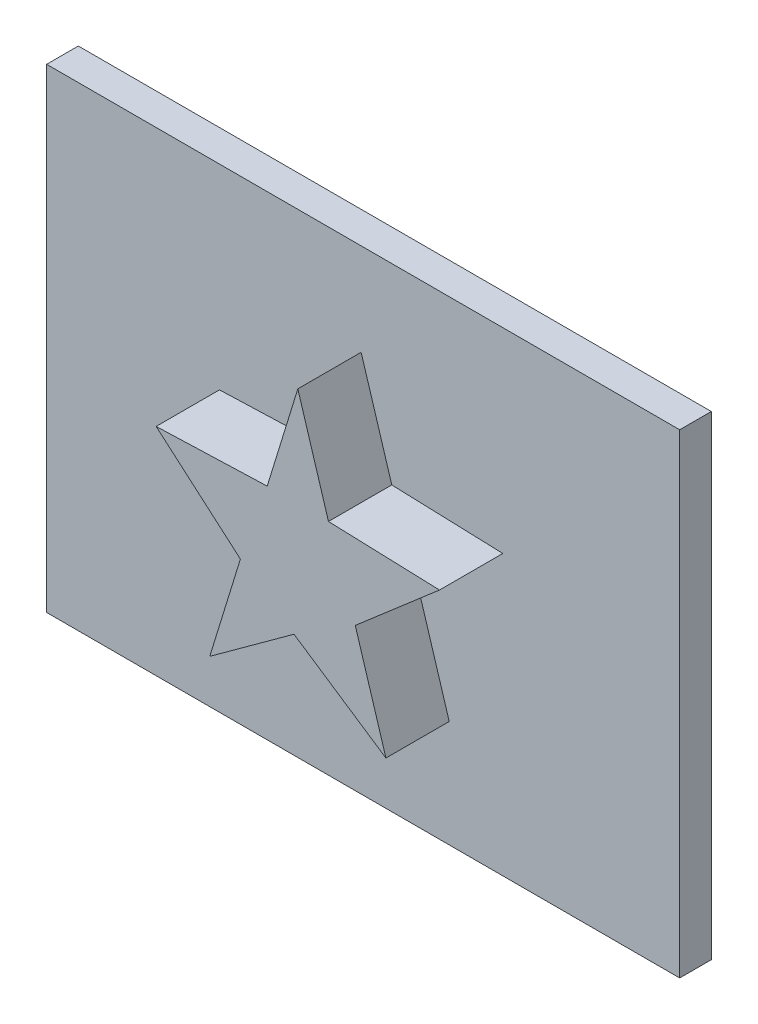
ISO-10303-21;
HEADER;
FILE_DESCRIPTION(('STEP AP214'),'2;1');
FILE_NAME('part.step','',(''),(''),'','','');
FILE_SCHEMA(('AUTOMOTIVE_DESIGN { 1 0 10303 214 1 1 1 1 }'));
ENDSEC;
DATA;
#1=APPLICATION_CONTEXT('core data for automotive mechanical design processes');
#2=APPLICATION_PROTOCOL_DEFINITION('international standard','automotive_design',2000,#1);
#3=PRODUCT_CONTEXT('',#1,'mechanical');
#4=PRODUCT('Part','Part','',(#3));
#5=PRODUCT_RELATED_PRODUCT_CATEGORY('part','',(#4));
#6=PRODUCT_DEFINITION_FORMATION('','',#4);
#7=PRODUCT_DEFINITION_CONTEXT('part definition',#1,'design');
#8=PRODUCT_DEFINITION('design','',#6,#7);
#9=PRODUCT_DEFINITION_SHAPE('','',#8);
#10=(LENGTH_UNIT() NAMED_UNIT(*) SI_UNIT(.MILLI.,.METRE.));
#11=(NAMED_UNIT(*) PLANE_ANGLE_UNIT() SI_UNIT($,.RADIAN.));
#12=(NAMED_UNIT(*) SI_UNIT($,.STERADIAN.) SOLID_ANGLE_UNIT());
#13=UNCERTAINTY_MEASURE_WITH_UNIT(LENGTH_MEASURE(1.E-05),#10,'distance_accuracy_value','');
#14=(GEOMETRIC_REPRESENTATION_CONTEXT(3) GLOBAL_UNCERTAINTY_ASSIGNED_CONTEXT((#13)) GLOBAL_UNIT_ASSIGNED_CONTEXT((#10,
#11,#12)) REPRESENTATION_CONTEXT('',''));
#15=CARTESIAN_POINT('',(0.,0.,0.));
#16=DIRECTION('',(0.,0.,1.));
#17=DIRECTION('',(1.,0.,0.));
#18=AXIS2_PLACEMENT_3D('',#15,#16,#17);
#19=CARTESIAN_POINT('',(20.,15.,2.));
#20=DIRECTION('',(-1.,0.,0.));
#21=DIRECTION('',(0.,-1.,0.));
#22=AXIS2_PLACEMENT_3D('',#19,#20,#21);
#23=PLANE('',#22);
#24=DIRECTION('',(0.,1.,0.));
#25=VECTOR('',#24,1.);
#26=CARTESIAN_POINT('',(20.,15.,0.));
#27=LINE('',#26,#25);
#28=CARTESIAN_POINT('',(20.,-15.,0.));
#29=VERTEX_POINT('',#28);
#30=CARTESIAN_POINT('',(20.,15.,0.));
#31=VERTEX_POINT('',#30);
#32=EDGE_CURVE('E164',#29,#31,#27,.T.);
#33=ORIENTED_EDGE('',*,*,#32,.T.);
#34=DIRECTION('',(0.,0.,-1.));
#35=VECTOR('',#34,1.);
#36=CARTESIAN_POINT('',(20.,15.,2.));
#37=LINE('',#36,#35);
#38=CARTESIAN_POINT('',(20.,15.,2.));
#39=VERTEX_POINT('',#38);
#40=EDGE_CURVE('E12',#39,#31,#37,.T.);
#41=ORIENTED_EDGE('',*,*,#40,.F.);
#42=DIRECTION('',(0.,1.,0.));
#43=VECTOR('',#42,1.);
#44=CARTESIAN_POINT('',(20.,15.,2.));
#45=LINE('',#44,#43);
#46=CARTESIAN_POINT('',(20.,-15.,2.));
#47=VERTEX_POINT('',#46);
#48=EDGE_CURVE('E173',#47,#39,#45,.T.);
#49=ORIENTED_EDGE('',*,*,#48,.F.);
#50=DIRECTION('',(0.,0.,-1.));
#51=VECTOR('',#50,1.);
#52=CARTESIAN_POINT('',(20.,-15.,2.));
#53=LINE('',#52,#51);
#54=EDGE_CURVE('E182',#47,#29,#53,.T.);
#55=ORIENTED_EDGE('',*,*,#54,.T.);
#56=EDGE_LOOP('',(#33,#41,#49,#55));
#57=FACE_BOUND('',#56,.T.);
#58=ADVANCED_FACE('F44',(#57),#23,.F.);
#59=CARTESIAN_POINT('',(-20.,15.,2.));
#60=DIRECTION('',(0.,-1.,0.));
#61=DIRECTION('',(0.,0.,-1.));
#62=AXIS2_PLACEMENT_3D('',#59,#60,#61);
#63=PLANE('',#62);
#64=DIRECTION('',(-1.,0.,0.));
#65=VECTOR('',#64,1.);
#66=CARTESIAN_POINT('',(-20.,15.,0.));
#67=LINE('',#66,#65);
#68=CARTESIAN_POINT('',(-20.,15.,0.));
#69=VERTEX_POINT('',#68);
#70=EDGE_CURVE('E167',#31,#69,#67,.T.);
#71=ORIENTED_EDGE('',*,*,#70,.T.);
#72=DIRECTION('',(0.,0.,-1.));
#73=VECTOR('',#72,1.);
#74=CARTESIAN_POINT('',(-20.,15.,2.));
#75=LINE('',#74,#73);
#76=CARTESIAN_POINT('',(-20.,15.,2.));
#77=VERTEX_POINT('',#76);
#78=EDGE_CURVE('E51',#77,#69,#75,.T.);
#79=ORIENTED_EDGE('',*,*,#78,.F.);
#80=DIRECTION('',(-1.,0.,0.));
#81=VECTOR('',#80,1.);
#82=CARTESIAN_POINT('',(-20.,15.,2.));
#83=LINE('',#82,#81);
#84=EDGE_CURVE('E176',#39,#77,#83,.T.);
#85=ORIENTED_EDGE('',*,*,#84,.F.);
#86=ORIENTED_EDGE('',*,*,#40,.T.);
#87=EDGE_LOOP('',(#71,#79,#85,#86));
#88=FACE_BOUND('',#87,.T.);
#89=ADVANCED_FACE('F213',(#88),#63,.F.);
#90=CARTESIAN_POINT('',(-20.,15.,2.));
#91=DIRECTION('',(1.,0.,0.));
#92=DIRECTION('',(0.,1.,0.));
#93=AXIS2_PLACEMENT_3D('',#90,#91,#92);
#94=PLANE('',#93);
#95=DIRECTION('',(0.,-1.,0.));
#96=VECTOR('',#95,1.);
#97=CARTESIAN_POINT('',(-20.,15.,0.));
#98=LINE('',#97,#96);
#99=CARTESIAN_POINT('',(-20.,-15.,0.));
#100=VERTEX_POINT('',#99);
#101=EDGE_CURVE('E185',#69,#100,#98,.T.);
#102=ORIENTED_EDGE('',*,*,#101,.T.);
#103=DIRECTION('',(0.,0.,-1.));
#104=VECTOR('',#103,1.);
#105=CARTESIAN_POINT('',(-20.,-15.,2.));
#106=LINE('',#105,#104);
#107=CARTESIAN_POINT('',(-20.,-15.,2.));
#108=VERTEX_POINT('',#107);
#109=EDGE_CURVE('E190',#108,#100,#106,.T.);
#110=ORIENTED_EDGE('',*,*,#109,.F.);
#111=DIRECTION('',(0.,-1.,0.));
#112=VECTOR('',#111,1.);
#113=CARTESIAN_POINT('',(-20.,15.,2.));
#114=LINE('',#113,#112);
#115=EDGE_CURVE('E179',#77,#108,#114,.T.);
#116=ORIENTED_EDGE('',*,*,#115,.F.);
#117=ORIENTED_EDGE('',*,*,#78,.T.);
#118=EDGE_LOOP('',(#102,#110,#116,#117));
#119=FACE_BOUND('',#118,.T.);
#120=ADVANCED_FACE('F197',(#119),#94,.F.);
#121=CARTESIAN_POINT('',(-20.,-15.,2.));
#122=DIRECTION('',(0.,1.,0.));
#123=DIRECTION('',(0.,0.,1.));
#124=AXIS2_PLACEMENT_3D('',#121,#122,#123);
#125=PLANE('',#124);
#126=DIRECTION('',(1.,0.,0.));
#127=VECTOR('',#126,1.);
#128=CARTESIAN_POINT('',(-20.,-15.,0.));
#129=LINE('',#128,#127);
#130=EDGE_CURVE('E177',#100,#29,#129,.T.);
#131=ORIENTED_EDGE('',*,*,#130,.T.);
#132=ORIENTED_EDGE('',*,*,#54,.F.);
#133=DIRECTION('',(1.,0.,0.));
#134=VECTOR('',#133,1.);
#135=CARTESIAN_POINT('',(-20.,-15.,2.));
#136=LINE('',#135,#134);
#137=EDGE_CURVE('E181',#108,#47,#136,.T.);
#138=ORIENTED_EDGE('',*,*,#137,.F.);
#139=ORIENTED_EDGE('',*,*,#109,.T.);
#140=EDGE_LOOP('',(#131,#132,#138,#139));
#141=FACE_BOUND('',#140,.T.);
#142=ADVANCED_FACE('F206',(#141),#125,.F.);
#143=CARTESIAN_POINT('',(0.,0.,2.));
#144=DIRECTION('',(0.,0.,1.));
#145=DIRECTION('',(1.,0.,0.));
#146=AXIS2_PLACEMENT_3D('',#143,#144,#145);
#147=PLANE('',#146);
#148=DIRECTION('',(-0.294085848837521,-0.955779008721951,0.));
#149=VECTOR('',#148,1.);
#150=CARTESIAN_POINT('',(-2.06434014465556,2.88457619473122,2.));
#151=LINE('',#150,#149);
#152=CARTESIAN_POINT('',(-0.128668655337221,9.17550853501588,2.));
#153=VERTEX_POINT('',#152);
#154=CARTESIAN_POINT('',(-2.06434014465556,2.88457619473122,2.));
#155=VERTEX_POINT('',#154);
#156=EDGE_CURVE('E58',#153,#155,#151,.T.);
#157=ORIENTED_EDGE('',*,*,#156,.F.);
#158=DIRECTION('',(-0.294085848837526,0.955779008721949,0.));
#159=VECTOR('',#158,1.);
#160=CARTESIAN_POINT('',(-0.128668655337221,9.17550853501588,2.));
#161=LINE('',#160,#159);
#162=CARTESIAN_POINT('',(1.80700283398116,2.88457619473122,2.));
#163=VERTEX_POINT('',#162);
#164=EDGE_CURVE('E62',#163,#153,#161,.T.);
#165=ORIENTED_EDGE('',*,*,#164,.F.);
#166=DIRECTION('',(-0.999405999353588,0.0344622758397794,0.));
#167=VECTOR('',#166,1.);
#168=CARTESIAN_POINT('',(1.80700283398116,2.88457619473122,2.));
#169=LINE('',#168,#167);
#170=CARTESIAN_POINT('',(8.82381198276018,2.64261725856642,2.));
#171=VERTEX_POINT('',#170);
#172=EDGE_CURVE('E436',#171,#163,#169,.T.);
#173=ORIENTED_EDGE('',*,*,#172,.F.);
#174=DIRECTION('',(0.75682300776916,0.653619870346092,0.));
#175=VECTOR('',#174,1.);
#176=CARTESIAN_POINT('',(8.82381198276018,2.64261725856642,2.));
#177=LINE('',#176,#175);
#178=CARTESIAN_POINT('',(3.50071538713469,-1.95460252856467,2.));
#179=VERTEX_POINT('',#178);
#180=EDGE_CURVE('E482',#179,#171,#177,.T.);
#181=ORIENTED_EDGE('',*,*,#180,.F.);
#182=DIRECTION('',(-0.294085848837526,0.955779008721949,0.));
#183=VECTOR('',#182,1.);
#184=CARTESIAN_POINT('',(3.50071538713469,-1.95460252856467,2.));
#185=LINE('',#184,#183);
#186=CARTESIAN_POINT('',(5.43638687645307,-8.24553486884933,2.));
#187=VERTEX_POINT('',#186);
#188=EDGE_CURVE('E479',#187,#179,#185,.T.);
#189=ORIENTED_EDGE('',*,*,#188,.F.);
#190=DIRECTION('',(0.832050294337845,-0.554700196225227,0.));
#191=VECTOR('',#190,1.);
#192=CARTESIAN_POINT('',(5.43638687645307,-8.24553486884933,2.));
#193=LINE('',#192,#191);
#194=CARTESIAN_POINT('',(-0.370627591502026,-4.37419189021262,2.));
#195=VERTEX_POINT('',#194);
#196=EDGE_CURVE('E476',#195,#187,#193,.T.);
#197=ORIENTED_EDGE('',*,*,#196,.F.);
#198=DIRECTION('',(0.808736084303189,0.588171697675046,0.));
#199=VECTOR('',#198,1.);
#200=CARTESIAN_POINT('',(-0.370627591502026,-4.37419189021262,2.));
#201=LINE('',#200,#199);
#202=CARTESIAN_POINT('',(-5.69372418712751,-8.24553486884933,2.));
#203=VERTEX_POINT('',#202);
#204=EDGE_CURVE('E469',#203,#195,#201,.T.);
#205=ORIENTED_EDGE('',*,*,#204,.F.);
#206=DIRECTION('',(-0.294085848837526,-0.955779008721949,0.));
#207=VECTOR('',#206,1.);
#208=CARTESIAN_POINT('',(-5.69372418712751,-8.24553486884933,2.));
#209=LINE('',#208,#207);
#210=CARTESIAN_POINT('',(-3.75805269780913,-1.95460252856467,2.));
#211=VERTEX_POINT('',#210);
#212=EDGE_CURVE('E463',#211,#203,#209,.T.);
#213=ORIENTED_EDGE('',*,*,#212,.F.);
#214=DIRECTION('',(0.756823007769159,-0.653619870346092,0.));
#215=VECTOR('',#214,1.);
#216=CARTESIAN_POINT('',(-3.75805269780913,-1.95460252856467,2.));
#217=LINE('',#216,#215);
#218=CARTESIAN_POINT('',(-9.08114929343462,2.64261725856643,2.));
#219=VERTEX_POINT('',#218);
#220=EDGE_CURVE('E466',#219,#211,#217,.T.);
#221=ORIENTED_EDGE('',*,*,#220,.F.);
#222=DIRECTION('',(-0.999405999353588,-0.0344622758397779,0.));
#223=VECTOR('',#222,1.);
#224=CARTESIAN_POINT('',(-9.08114929343462,2.64261725856643,2.));
#225=LINE('',#224,#223);
#226=EDGE_CURVE('E467',#155,#219,#225,.T.);
#227=ORIENTED_EDGE('',*,*,#226,.F.);
#228=EDGE_LOOP('',(#157,#165,#173,#181,#189,#197,#205,#213,#221,#227));
#229=FACE_BOUND('',#228,.T.);
#230=ORIENTED_EDGE('',*,*,#48,.T.);
#231=ORIENTED_EDGE('',*,*,#84,.T.);
#232=ORIENTED_EDGE('',*,*,#115,.T.);
#233=ORIENTED_EDGE('',*,*,#137,.T.);
#234=EDGE_LOOP('',(#230,#231,#232,#233));
#235=FACE_BOUND('',#234,.T.);
#236=ADVANCED_FACE('F212',(#229,#235),#147,.T.);
#237=CARTESIAN_POINT('',(0.,0.,0.));
#238=DIRECTION('',(0.,0.,1.));
#239=DIRECTION('',(1.,0.,0.));
#240=AXIS2_PLACEMENT_3D('',#237,#238,#239);
#241=PLANE('',#240);
#242=ORIENTED_EDGE('',*,*,#32,.F.);
#243=ORIENTED_EDGE('',*,*,#130,.F.);
#244=ORIENTED_EDGE('',*,*,#101,.F.);
#245=ORIENTED_EDGE('',*,*,#70,.F.);
#246=EDGE_LOOP('',(#242,#243,#244,#245));
#247=FACE_BOUND('',#246,.T.);
#248=ADVANCED_FACE('F203',(#247),#241,.F.);
#249=CARTESIAN_POINT('',(-2.06434014465556,2.88457619473122,6.));
#250=DIRECTION('',(0.955779008721951,-0.294085848837521,0.));
#251=DIRECTION('',(0.294085848837521,0.955779008721951,0.));
#252=AXIS2_PLACEMENT_3D('',#249,#250,#251);
#253=PLANE('',#252);
#254=ORIENTED_EDGE('',*,*,#156,.T.);
#255=DIRECTION('',(0.,0.,-1.));
#256=VECTOR('',#255,1.);
#257=CARTESIAN_POINT('',(-2.06434014465556,2.88457619473122,6.));
#258=LINE('',#257,#256);
#259=CARTESIAN_POINT('',(-2.06434014465556,2.88457619473122,6.));
#260=VERTEX_POINT('',#259);
#261=EDGE_CURVE('E147',#260,#155,#258,.T.);
#262=ORIENTED_EDGE('',*,*,#261,.F.);
#263=DIRECTION('',(-0.294085848837521,-0.955779008721951,0.));
#264=VECTOR('',#263,1.);
#265=CARTESIAN_POINT('',(-2.06434014465556,2.88457619473122,6.));
#266=LINE('',#265,#264);
#267=CARTESIAN_POINT('',(-0.128668655337221,9.17550853501588,6.));
#268=VERTEX_POINT('',#267);
#269=EDGE_CURVE('E153',#268,#260,#266,.T.);
#270=ORIENTED_EDGE('',*,*,#269,.F.);
#271=DIRECTION('',(0.,0.,-1.));
#272=VECTOR('',#271,1.);
#273=CARTESIAN_POINT('',(-0.128668655337221,9.17550853501588,6.));
#274=LINE('',#273,#272);
#275=EDGE_CURVE('E433',#268,#153,#274,.T.);
#276=ORIENTED_EDGE('',*,*,#275,.T.);
#277=EDGE_LOOP('',(#254,#262,#270,#276));
#278=FACE_BOUND('',#277,.T.);
#279=ADVANCED_FACE('F163',(#278),#253,.F.);
#280=CARTESIAN_POINT('',(-9.08114929343462,2.64261725856643,6.));
#281=DIRECTION('',(0.0344622758397779,-0.999405999353588,0.));
#282=DIRECTION('',(0.999405999353588,0.0344622758397779,0.));
#283=AXIS2_PLACEMENT_3D('',#280,#281,#282);
#284=PLANE('',#283);
#285=ORIENTED_EDGE('',*,*,#226,.T.);
#286=DIRECTION('',(0.,0.,-1.));
#287=VECTOR('',#286,1.);
#288=CARTESIAN_POINT('',(-9.08114929343462,2.64261725856643,6.));
#289=LINE('',#288,#287);
#290=CARTESIAN_POINT('',(-9.08114929343462,2.64261725856643,6.));
#291=VERTEX_POINT('',#290);
#292=EDGE_CURVE('E149',#291,#219,#289,.T.);
#293=ORIENTED_EDGE('',*,*,#292,.F.);
#294=DIRECTION('',(-0.999405999353588,-0.0344622758397779,0.));
#295=VECTOR('',#294,1.);
#296=CARTESIAN_POINT('',(-9.08114929343462,2.64261725856643,6.));
#297=LINE('',#296,#295);
#298=EDGE_CURVE('E142',#260,#291,#297,.T.);
#299=ORIENTED_EDGE('',*,*,#298,.F.);
#300=ORIENTED_EDGE('',*,*,#261,.T.);
#301=EDGE_LOOP('',(#285,#293,#299,#300));
#302=FACE_BOUND('',#301,.T.);
#303=ADVANCED_FACE('F145',(#302),#284,.F.);
#304=CARTESIAN_POINT('',(-3.75805269780913,-1.95460252856467,6.));
#305=DIRECTION('',(0.653619870346093,0.756823007769159,0.));
#306=DIRECTION('',(-0.756823007769159,0.653619870346093,0.));
#307=AXIS2_PLACEMENT_3D('',#304,#305,#306);
#308=PLANE('',#307);
#309=ORIENTED_EDGE('',*,*,#220,.T.);
#310=DIRECTION('',(0.,0.,-1.));
#311=VECTOR('',#310,1.);
#312=CARTESIAN_POINT('',(-3.75805269780913,-1.95460252856467,6.));
#313=LINE('',#312,#311);
#314=CARTESIAN_POINT('',(-3.75805269780913,-1.95460252856467,6.));
#315=VERTEX_POINT('',#314);
#316=EDGE_CURVE('E169',#315,#211,#313,.T.);
#317=ORIENTED_EDGE('',*,*,#316,.F.);
#318=DIRECTION('',(0.756823007769159,-0.653619870346092,0.));
#319=VECTOR('',#318,1.);
#320=CARTESIAN_POINT('',(-3.75805269780913,-1.95460252856467,6.));
#321=LINE('',#320,#319);
#322=EDGE_CURVE('E152',#291,#315,#321,.T.);
#323=ORIENTED_EDGE('',*,*,#322,.F.);
#324=ORIENTED_EDGE('',*,*,#292,.T.);
#325=EDGE_LOOP('',(#309,#317,#323,#324));
#326=FACE_BOUND('',#325,.T.);
#327=ADVANCED_FACE('F231',(#326),#308,.F.);
#328=CARTESIAN_POINT('',(-5.69372418712751,-8.24553486884933,6.));
#329=DIRECTION('',(0.955779008721949,-0.294085848837526,0.));
#330=DIRECTION('',(0.294085848837526,0.955779008721949,0.));
#331=AXIS2_PLACEMENT_3D('',#328,#329,#330);
#332=PLANE('',#331);
#333=ORIENTED_EDGE('',*,*,#212,.T.);
#334=DIRECTION('',(0.,0.,-1.));
#335=VECTOR('',#334,1.);
#336=CARTESIAN_POINT('',(-5.69372418712751,-8.24553486884933,6.));
#337=LINE('',#336,#335);
#338=CARTESIAN_POINT('',(-5.69372418712751,-8.24553486884933,6.));
#339=VERTEX_POINT('',#338);
#340=EDGE_CURVE('E456',#339,#203,#337,.T.);
#341=ORIENTED_EDGE('',*,*,#340,.F.);
#342=DIRECTION('',(-0.294085848837526,-0.955779008721949,0.));
#343=VECTOR('',#342,1.);
#344=CARTESIAN_POINT('',(-5.69372418712751,-8.24553486884933,6.));
#345=LINE('',#344,#343);
#346=EDGE_CURVE('E464',#315,#339,#345,.T.);
#347=ORIENTED_EDGE('',*,*,#346,.F.);
#348=ORIENTED_EDGE('',*,*,#316,.T.);
#349=EDGE_LOOP('',(#333,#341,#347,#348));
#350=FACE_BOUND('',#349,.T.);
#351=ADVANCED_FACE('F234',(#350),#332,.F.);
#352=CARTESIAN_POINT('',(-0.370627591502026,-4.37419189021262,6.));
#353=DIRECTION('',(-0.588171697675046,0.808736084303189,0.));
#354=DIRECTION('',(-0.808736084303189,-0.588171697675046,0.));
#355=AXIS2_PLACEMENT_3D('',#352,#353,#354);
#356=PLANE('',#355);
#357=ORIENTED_EDGE('',*,*,#204,.T.);
#358=DIRECTION('',(0.,0.,-1.));
#359=VECTOR('',#358,1.);
#360=CARTESIAN_POINT('',(-0.370627591502026,-4.37419189021262,6.));
#361=LINE('',#360,#359);
#362=CARTESIAN_POINT('',(-0.370627591502026,-4.37419189021262,6.));
#363=VERTEX_POINT('',#362);
#364=EDGE_CURVE('E453',#363,#195,#361,.T.);
#365=ORIENTED_EDGE('',*,*,#364,.F.);
#366=DIRECTION('',(0.808736084303189,0.588171697675046,0.));
#367=VECTOR('',#366,1.);
#368=CARTESIAN_POINT('',(-0.370627591502026,-4.37419189021262,6.));
#369=LINE('',#368,#367);
#370=EDGE_CURVE('E496',#339,#363,#369,.T.);
#371=ORIENTED_EDGE('',*,*,#370,.F.);
#372=ORIENTED_EDGE('',*,*,#340,.T.);
#373=EDGE_LOOP('',(#357,#365,#371,#372));
#374=FACE_BOUND('',#373,.T.);
#375=ADVANCED_FACE('F238',(#374),#356,.F.);
#376=CARTESIAN_POINT('',(5.43638687645307,-8.24553486884933,6.));
#377=DIRECTION('',(0.554700196225227,0.832050294337845,0.));
#378=DIRECTION('',(-0.832050294337845,0.554700196225227,0.));
#379=AXIS2_PLACEMENT_3D('',#376,#377,#378);
#380=PLANE('',#379);
#381=ORIENTED_EDGE('',*,*,#196,.T.);
#382=DIRECTION('',(0.,0.,-1.));
#383=VECTOR('',#382,1.);
#384=CARTESIAN_POINT('',(5.43638687645307,-8.24553486884933,6.));
#385=LINE('',#384,#383);
#386=CARTESIAN_POINT('',(5.43638687645307,-8.24553486884933,6.));
#387=VERTEX_POINT('',#386);
#388=EDGE_CURVE('E450',#387,#187,#385,.T.);
#389=ORIENTED_EDGE('',*,*,#388,.F.);
#390=DIRECTION('',(0.832050294337845,-0.554700196225227,0.));
#391=VECTOR('',#390,1.);
#392=CARTESIAN_POINT('',(5.43638687645307,-8.24553486884933,6.));
#393=LINE('',#392,#391);
#394=EDGE_CURVE('E494',#363,#387,#393,.T.);
#395=ORIENTED_EDGE('',*,*,#394,.F.);
#396=ORIENTED_EDGE('',*,*,#364,.T.);
#397=EDGE_LOOP('',(#381,#389,#395,#396));
#398=FACE_BOUND('',#397,.T.);
#399=ADVANCED_FACE('F242',(#398),#380,.F.);
#400=CARTESIAN_POINT('',(3.50071538713469,-1.95460252856467,6.));
#401=DIRECTION('',(-0.955779008721949,-0.294085848837526,0.));
#402=DIRECTION('',(0.294085848837526,-0.955779008721949,0.));
#403=AXIS2_PLACEMENT_3D('',#400,#401,#402);
#404=PLANE('',#403);
#405=ORIENTED_EDGE('',*,*,#188,.T.);
#406=DIRECTION('',(0.,0.,-1.));
#407=VECTOR('',#406,1.);
#408=CARTESIAN_POINT('',(3.50071538713469,-1.95460252856467,6.));
#409=LINE('',#408,#407);
#410=CARTESIAN_POINT('',(3.50071538713469,-1.95460252856467,6.));
#411=VERTEX_POINT('',#410);
#412=EDGE_CURVE('E447',#411,#179,#409,.T.);
#413=ORIENTED_EDGE('',*,*,#412,.F.);
#414=DIRECTION('',(-0.294085848837526,0.955779008721949,0.));
#415=VECTOR('',#414,1.);
#416=CARTESIAN_POINT('',(3.50071538713469,-1.95460252856467,6.));
#417=LINE('',#416,#415);
#418=EDGE_CURVE('E490',#387,#411,#417,.T.);
#419=ORIENTED_EDGE('',*,*,#418,.F.);
#420=ORIENTED_EDGE('',*,*,#388,.T.);
#421=EDGE_LOOP('',(#405,#413,#419,#420));
#422=FACE_BOUND('',#421,.T.);
#423=ADVANCED_FACE('F246',(#422),#404,.F.);
#424=CARTESIAN_POINT('',(8.82381198276018,2.64261725856642,6.));
#425=DIRECTION('',(-0.653619870346092,0.75682300776916,0.));
#426=DIRECTION('',(-0.75682300776916,-0.653619870346092,0.));
#427=AXIS2_PLACEMENT_3D('',#424,#425,#426);
#428=PLANE('',#427);
#429=ORIENTED_EDGE('',*,*,#180,.T.);
#430=DIRECTION('',(0.,0.,-1.));
#431=VECTOR('',#430,1.);
#432=CARTESIAN_POINT('',(8.82381198276018,2.64261725856642,6.));
#433=LINE('',#432,#431);
#434=CARTESIAN_POINT('',(8.82381198276018,2.64261725856642,6.));
#435=VERTEX_POINT('',#434);
#436=EDGE_CURVE('E439',#435,#171,#433,.T.);
#437=ORIENTED_EDGE('',*,*,#436,.F.);
#438=DIRECTION('',(0.75682300776916,0.653619870346092,0.));
#439=VECTOR('',#438,1.);
#440=CARTESIAN_POINT('',(8.82381198276018,2.64261725856642,6.));
#441=LINE('',#440,#439);
#442=EDGE_CURVE('E488',#411,#435,#441,.T.);
#443=ORIENTED_EDGE('',*,*,#442,.F.);
#444=ORIENTED_EDGE('',*,*,#412,.T.);
#445=EDGE_LOOP('',(#429,#437,#443,#444));
#446=FACE_BOUND('',#445,.T.);
#447=ADVANCED_FACE('F250',(#446),#428,.F.);
#448=CARTESIAN_POINT('',(1.80700283398116,2.88457619473122,6.));
#449=DIRECTION('',(-0.0344622758397794,-0.999405999353588,0.));
#450=DIRECTION('',(0.999405999353588,-0.0344622758397794,0.));
#451=AXIS2_PLACEMENT_3D('',#448,#449,#450);
#452=PLANE('',#451);
#453=ORIENTED_EDGE('',*,*,#172,.T.);
#454=DIRECTION('',(0.,0.,-1.));
#455=VECTOR('',#454,1.);
#456=CARTESIAN_POINT('',(1.80700283398116,2.88457619473122,6.));
#457=LINE('',#456,#455);
#458=CARTESIAN_POINT('',(1.80700283398116,2.88457619473122,6.));
#459=VERTEX_POINT('',#458);
#460=EDGE_CURVE('E435',#459,#163,#457,.T.);
#461=ORIENTED_EDGE('',*,*,#460,.F.);
#462=DIRECTION('',(-0.999405999353588,0.0344622758397794,0.));
#463=VECTOR('',#462,1.);
#464=CARTESIAN_POINT('',(1.80700283398116,2.88457619473122,6.));
#465=LINE('',#464,#463);
#466=EDGE_CURVE('E441',#435,#459,#465,.T.);
#467=ORIENTED_EDGE('',*,*,#466,.F.);
#468=ORIENTED_EDGE('',*,*,#436,.T.);
#469=EDGE_LOOP('',(#453,#461,#467,#468));
#470=FACE_BOUND('',#469,.T.);
#471=ADVANCED_FACE('F254',(#470),#452,.F.);
#472=CARTESIAN_POINT('',(-0.128668655337221,9.17550853501588,6.));
#473=DIRECTION('',(-0.955779008721949,-0.294085848837526,0.));
#474=DIRECTION('',(0.294085848837526,-0.955779008721949,0.));
#475=AXIS2_PLACEMENT_3D('',#472,#473,#474);
#476=PLANE('',#475);
#477=ORIENTED_EDGE('',*,*,#164,.T.);
#478=ORIENTED_EDGE('',*,*,#275,.F.);
#479=DIRECTION('',(-0.294085848837526,0.955779008721949,0.));
#480=VECTOR('',#479,1.);
#481=CARTESIAN_POINT('',(-0.128668655337221,9.17550853501588,6.));
#482=LINE('',#481,#480);
#483=EDGE_CURVE('E158',#459,#268,#482,.T.);
#484=ORIENTED_EDGE('',*,*,#483,.F.);
#485=ORIENTED_EDGE('',*,*,#460,.T.);
#486=EDGE_LOOP('',(#477,#478,#484,#485));
#487=FACE_BOUND('',#486,.T.);
#488=ADVANCED_FACE('F258',(#487),#476,.F.);
#489=CARTESIAN_POINT('',(0.,0.,6.));
#490=DIRECTION('',(0.,0.,-1.));
#491=DIRECTION('',(-1.,0.,0.));
#492=AXIS2_PLACEMENT_3D('',#489,#490,#491);
#493=PLANE('',#492);
#494=ORIENTED_EDGE('',*,*,#269,.T.);
#495=ORIENTED_EDGE('',*,*,#298,.T.);
#496=ORIENTED_EDGE('',*,*,#322,.T.);
#497=ORIENTED_EDGE('',*,*,#346,.T.);
#498=ORIENTED_EDGE('',*,*,#370,.T.);
#499=ORIENTED_EDGE('',*,*,#394,.T.);
#500=ORIENTED_EDGE('',*,*,#418,.T.);
#501=ORIENTED_EDGE('',*,*,#442,.T.);
#502=ORIENTED_EDGE('',*,*,#466,.T.);
#503=ORIENTED_EDGE('',*,*,#483,.T.);
#504=EDGE_LOOP('',(#494,#495,#496,#497,#498,#499,#500,#501,#502,#503));
#505=FACE_BOUND('',#504,.T.);
#506=ADVANCED_FACE('F156',(#505),#493,.F.);
#507=CLOSED_SHELL('',(#58,#89,#120,#142,#236,#248,#279,#303,#327,#351,#375,#399,#423,#447,#471,
#488,#506));
#508=MANIFOLD_SOLID_BREP('B2',#507);
#509=ADVANCED_BREP_SHAPE_REPRESENTATION('',(#18,#508),#14);
#510=SHAPE_DEFINITION_REPRESENTATION(#9,#509);
ENDSEC;
END-ISO-10303-21;
